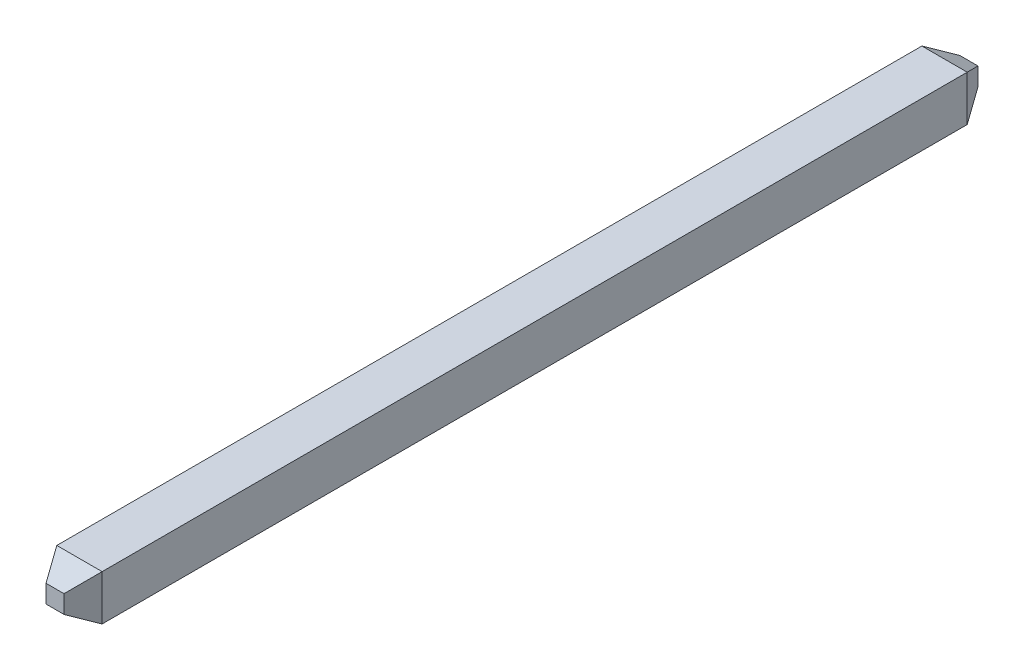
ISO-10303-21;
HEADER;
FILE_DESCRIPTION(('STEP AP214'),'2;1');
FILE_NAME('part.step','',(''),(''),'','','');
FILE_SCHEMA(('AUTOMOTIVE_DESIGN { 1 0 10303 214 1 1 1 1 }'));
ENDSEC;
DATA;
#1=APPLICATION_CONTEXT('core data for automotive mechanical design processes');
#2=APPLICATION_PROTOCOL_DEFINITION('international standard','automotive_design',2000,#1);
#3=PRODUCT_CONTEXT('',#1,'mechanical');
#4=PRODUCT('Part','Part','',(#3));
#5=PRODUCT_RELATED_PRODUCT_CATEGORY('part','',(#4));
#6=PRODUCT_DEFINITION_FORMATION('','',#4);
#7=PRODUCT_DEFINITION_CONTEXT('part definition',#1,'design');
#8=PRODUCT_DEFINITION('design','',#6,#7);
#9=PRODUCT_DEFINITION_SHAPE('','',#8);
#10=(LENGTH_UNIT() NAMED_UNIT(*) SI_UNIT(.MILLI.,.METRE.));
#11=(NAMED_UNIT(*) PLANE_ANGLE_UNIT() SI_UNIT($,.RADIAN.));
#12=(NAMED_UNIT(*) SI_UNIT($,.STERADIAN.) SOLID_ANGLE_UNIT());
#13=UNCERTAINTY_MEASURE_WITH_UNIT(LENGTH_MEASURE(1.E-05),#10,'distance_accuracy_value','');
#14=(GEOMETRIC_REPRESENTATION_CONTEXT(3) GLOBAL_UNCERTAINTY_ASSIGNED_CONTEXT((#13)) GLOBAL_UNIT_ASSIGNED_CONTEXT((#10,
#11,#12)) REPRESENTATION_CONTEXT('',''));
#15=CARTESIAN_POINT('',(0.,0.,0.));
#16=DIRECTION('',(0.,0.,1.));
#17=DIRECTION('',(1.,0.,0.));
#18=AXIS2_PLACEMENT_3D('',#15,#16,#17);
#19=CARTESIAN_POINT('',(7.74011510041924,-1.595,-3.20872569516347));
#20=DIRECTION('',(0.872569516347452,0.,-0.488489958076083));
#21=DIRECTION('',(-0.488489958076083,0.,-0.872569516347452));
#22=AXIS2_PLACEMENT_3D('',#19,#20,#21);
#23=PLANE('',#22);
#24=DIRECTION('',(0.,1.,0.));
#25=VECTOR('',#24,1.);
#26=CARTESIAN_POINT('',(7.93534185664469,-1.595,-2.86000017186176));
#27=LINE('',#26,#25);
#28=CARTESIAN_POINT('',(7.93534185663263,-1.58500002468493,-2.85999984563027));
#29=VERTEX_POINT('',#28);
#30=CARTESIAN_POINT('',(7.93534201729187,-0.954999839641339,-2.8599998849043));
#31=VERTEX_POINT('',#30);
#32=EDGE_CURVE('E145',#29,#31,#27,.T.);
#33=ORIENTED_EDGE('',*,*,#32,.F.);
#34=DIRECTION('',(0.43907261756865,-0.438284036988111,0.784297353956278));
#35=VECTOR('',#34,1.);
#36=CARTESIAN_POINT('',(7.745,-1.395,-3.2));
#37=LINE('',#36,#35);
#38=CARTESIAN_POINT('',(7.745,-1.395,-3.2));
#39=VERTEX_POINT('',#38);
#40=EDGE_CURVE('E142',#39,#29,#37,.T.);
#41=ORIENTED_EDGE('',*,*,#40,.F.);
#42=DIRECTION('',(0.,1.,0.));
#43=VECTOR('',#42,1.);
#44=CARTESIAN_POINT('',(7.745,-1.405,-3.2));
#45=LINE('',#44,#43);
#46=CARTESIAN_POINT('',(7.745,-1.145,-3.2));
#47=VERTEX_POINT('',#46);
#48=EDGE_CURVE('E95',#47,#39,#45,.F.);
#49=ORIENTED_EDGE('',*,*,#48,.F.);
#50=DIRECTION('',(-0.439072617568649,-0.43828403698811,-0.784297353956278));
#51=VECTOR('',#50,1.);
#52=CARTESIAN_POINT('',(7.93534185664468,-0.955000000000001,-2.86000017186176));
#53=LINE('',#52,#51);
#54=EDGE_CURVE('E134',#31,#47,#53,.T.);
#55=ORIENTED_EDGE('',*,*,#54,.F.);
#56=EDGE_LOOP('',(#33,#41,#49,#55));
#57=FACE_BOUND('',#56,.T.);
#58=ADVANCED_FACE('F16',(#57),#23,.T.);
#59=CARTESIAN_POINT('',(7.74036702814295,-1.595,9.50441734607014));
#60=DIRECTION('',(0.873317045523298,0.,0.487152273933376));
#61=DIRECTION('',(0.487152273933376,0.,-0.873317045523298));
#62=AXIS2_PLACEMENT_3D('',#59,#60,#61);
#63=PLANE('',#62);
#64=DIRECTION('',(-0.437799852400914,0.438586917260841,0.784839349959831));
#65=VECTOR('',#64,1.);
#66=CARTESIAN_POINT('',(7.93489789955165,-1.58500031317147,9.15568378706484));
#67=LINE('',#66,#65);
#68=CARTESIAN_POINT('',(7.93489765454993,-1.58500010892315,9.15568368845102));
#69=VERTEX_POINT('',#68);
#70=CARTESIAN_POINT('',(7.74523855088228,-1.395,9.49568417561491));
#71=VERTEX_POINT('',#70);
#72=EDGE_CURVE('E151',#69,#71,#67,.T.);
#73=ORIENTED_EDGE('',*,*,#72,.F.);
#74=DIRECTION('',(0.,1.,0.));
#75=VECTOR('',#74,1.);
#76=CARTESIAN_POINT('',(7.93489853900643,-1.595,9.15568372243698));
#77=LINE('',#76,#75);
#78=CARTESIAN_POINT('',(7.93489765280461,-0.954999822967399,9.15568371270385));
#79=VERTEX_POINT('',#78);
#80=EDGE_CURVE('E106',#79,#69,#77,.F.);
#81=ORIENTED_EDGE('',*,*,#80,.F.);
#82=DIRECTION('',(0.437799852400912,0.438586917260841,-0.784839349959832));
#83=VECTOR('',#82,1.);
#84=CARTESIAN_POINT('',(7.74523855088228,-1.145,9.49568417561491));
#85=LINE('',#84,#83);
#86=CARTESIAN_POINT('',(7.74523855088228,-1.145,9.49568417561491));
#87=VERTEX_POINT('',#86);
#88=EDGE_CURVE('E101',#87,#79,#85,.T.);
#89=ORIENTED_EDGE('',*,*,#88,.F.);
#90=DIRECTION('',(0.,1.,0.));
#91=VECTOR('',#90,1.);
#92=CARTESIAN_POINT('',(7.74523855088228,-1.135,9.49568417561491));
#93=LINE('',#92,#91);
#94=EDGE_CURVE('E19',#71,#87,#93,.T.);
#95=ORIENTED_EDGE('',*,*,#94,.F.);
#96=EDGE_LOOP('',(#73,#81,#89,#95));
#97=FACE_BOUND('',#96,.T.);
#98=ADVANCED_FACE('F103',(#97),#63,.T.);
#99=CARTESIAN_POINT('',(7.48523855088228,-1.135,9.49568417561491));
#100=DIRECTION('',(0.,0.,1.));
#101=DIRECTION('',(1.,0.,0.));
#102=AXIS2_PLACEMENT_3D('',#99,#100,#101);
#103=PLANE('',#102);
#104=DIRECTION('',(1.,0.,0.));
#105=VECTOR('',#104,1.);
#106=CARTESIAN_POINT('',(7.2948966942376,-1.145,9.49568417561491));
#107=LINE('',#106,#105);
#108=CARTESIAN_POINT('',(7.49523855088228,-1.145,9.49568417561491));
#109=VERTEX_POINT('',#108);
#110=EDGE_CURVE('E111',#109,#87,#107,.T.);
#111=ORIENTED_EDGE('',*,*,#110,.F.);
#112=DIRECTION('',(0.,1.,0.));
#113=VECTOR('',#112,1.);
#114=CARTESIAN_POINT('',(7.49523855088228,-1.595,9.49568417561491));
#115=LINE('',#114,#113);
#116=CARTESIAN_POINT('',(7.49523855088228,-1.395,9.49568417561491));
#117=VERTEX_POINT('',#116);
#118=EDGE_CURVE('E162',#117,#109,#115,.T.);
#119=ORIENTED_EDGE('',*,*,#118,.F.);
#120=DIRECTION('',(1.,0.,0.));
#121=VECTOR('',#120,1.);
#122=CARTESIAN_POINT('',(7.2948966942376,-1.395,9.49568417561491));
#123=LINE('',#122,#121);
#124=EDGE_CURVE('E116',#71,#117,#123,.F.);
#125=ORIENTED_EDGE('',*,*,#124,.F.);
#126=ORIENTED_EDGE('',*,*,#94,.T.);
#127=EDGE_LOOP('',(#111,#119,#125,#126));
#128=FACE_BOUND('',#127,.T.);
#129=ADVANCED_FACE('F113',(#128),#103,.T.);
#130=CARTESIAN_POINT('',(7.2948966942376,-1.14987821545568,9.50441360938624));
#131=DIRECTION('',(0.,0.872943377132664,0.487821545567864));
#132=DIRECTION('',(0.,-0.487821545567864,0.872943377132664));
#133=AXIS2_PLACEMENT_3D('',#130,#131,#132);
#134=PLANE('',#133);
#135=DIRECTION('',(-0.439072459537929,0.438284700441656,-0.784297071672515));
#136=VECTOR('',#135,1.);
#137=CARTESIAN_POINT('',(7.49523855088228,-1.145,9.49568417561491));
#138=LINE('',#137,#136);
#139=CARTESIAN_POINT('',(7.3048975037028,-0.954999917527424,9.15568447138296));
#140=VERTEX_POINT('',#139);
#141=EDGE_CURVE('E121',#109,#140,#138,.T.);
#142=ORIENTED_EDGE('',*,*,#141,.F.);
#143=ORIENTED_EDGE('',*,*,#110,.T.);
#144=ORIENTED_EDGE('',*,*,#88,.T.);
#145=DIRECTION('',(1.,0.,0.));
#146=VECTOR('',#145,1.);
#147=CARTESIAN_POINT('',(7.62006658937282,-0.955,9.15568497320463));
#148=LINE('',#147,#146);
#149=EDGE_CURVE('E165',#140,#79,#148,.T.);
#150=ORIENTED_EDGE('',*,*,#149,.F.);
#151=EDGE_LOOP('',(#142,#143,#144,#150));
#152=FACE_BOUND('',#151,.T.);
#153=ADVANCED_FACE('F119',(#152),#134,.T.);
#154=CARTESIAN_POINT('',(7.485,-1.405,-3.2));
#155=DIRECTION('',(0.,0.,-1.));
#156=DIRECTION('',(-1.,0.,0.));
#157=AXIS2_PLACEMENT_3D('',#154,#155,#156);
#158=PLANE('',#157);
#159=ORIENTED_EDGE('',*,*,#48,.T.);
#160=DIRECTION('',(1.,0.,0.));
#161=VECTOR('',#160,1.);
#162=CARTESIAN_POINT('',(7.29534185664468,-1.395,-3.2));
#163=LINE('',#162,#161);
#164=CARTESIAN_POINT('',(7.495,-1.395,-3.2));
#165=VERTEX_POINT('',#164);
#166=EDGE_CURVE('E138',#165,#39,#163,.T.);
#167=ORIENTED_EDGE('',*,*,#166,.F.);
#168=DIRECTION('',(0.,1.,0.));
#169=VECTOR('',#168,1.);
#170=CARTESIAN_POINT('',(7.49500000000001,-1.595,-3.2));
#171=LINE('',#170,#169);
#172=CARTESIAN_POINT('',(7.495,-1.145,-3.2));
#173=VERTEX_POINT('',#172);
#174=EDGE_CURVE('E177',#173,#165,#171,.F.);
#175=ORIENTED_EDGE('',*,*,#174,.F.);
#176=DIRECTION('',(1.,0.,0.));
#177=VECTOR('',#176,1.);
#178=CARTESIAN_POINT('',(7.29534185664468,-1.145,-3.2));
#179=LINE('',#178,#177);
#180=EDGE_CURVE('E128',#47,#173,#179,.F.);
#181=ORIENTED_EDGE('',*,*,#180,.F.);
#182=EDGE_LOOP('',(#159,#167,#175,#181));
#183=FACE_BOUND('',#182,.T.);
#184=ADVANCED_FACE('F229',(#183),#158,.T.);
#185=CARTESIAN_POINT('',(7.29534185664468,-0.950121784544321,-2.85127073809043));
#186=DIRECTION('',(0.,0.872943377132663,-0.487821545567865));
#187=DIRECTION('',(0.,0.487821545567865,0.872943377132663));
#188=AXIS2_PLACEMENT_3D('',#185,#186,#187);
#189=PLANE('',#188);
#190=DIRECTION('',(1.,0.,0.));
#191=VECTOR('',#190,1.);
#192=CARTESIAN_POINT('',(7.62006658937282,-0.955,-2.86000017186176));
#193=LINE('',#192,#191);
#194=CARTESIAN_POINT('',(7.30534144768619,-0.954999293190895,-2.8599984305592));
#195=VERTEX_POINT('',#194);
#196=EDGE_CURVE('E173',#31,#195,#193,.F.);
#197=ORIENTED_EDGE('',*,*,#196,.F.);
#198=ORIENTED_EDGE('',*,*,#54,.T.);
#199=ORIENTED_EDGE('',*,*,#180,.T.);
#200=DIRECTION('',(0.437798396819595,-0.438586429089663,-0.784840434713051));
#201=VECTOR('',#200,1.);
#202=CARTESIAN_POINT('',(7.30534066407532,-0.954999279369218,-2.8599980339447));
#203=LINE('',#202,#201);
#204=EDGE_CURVE('E184',#195,#173,#203,.T.);
#205=ORIENTED_EDGE('',*,*,#204,.F.);
#206=EDGE_LOOP('',(#197,#198,#199,#205));
#207=FACE_BOUND('',#206,.T.);
#208=ADVANCED_FACE('F227',(#207),#189,.T.);
#209=CARTESIAN_POINT('',(7.29534185664468,-1.39012178454432,-3.20872943377133));
#210=DIRECTION('',(0.,-0.872943377132663,-0.487821545567865));
#211=DIRECTION('',(0.,0.487821545567865,-0.872943377132663));
#212=AXIS2_PLACEMENT_3D('',#209,#210,#211);
#213=PLANE('',#212);
#214=ORIENTED_EDGE('',*,*,#166,.T.);
#215=ORIENTED_EDGE('',*,*,#40,.T.);
#216=DIRECTION('',(1.,0.,0.));
#217=VECTOR('',#216,1.);
#218=CARTESIAN_POINT('',(7.29494834685547,-1.585,-2.85999756200982));
#219=LINE('',#218,#217);
#220=CARTESIAN_POINT('',(7.30534198218489,-1.58500027023654,-2.85999898491791));
#221=VERTEX_POINT('',#220);
#222=EDGE_CURVE('E39',#221,#29,#219,.T.);
#223=ORIENTED_EDGE('',*,*,#222,.F.);
#224=DIRECTION('',(-0.437798396819596,-0.43858642908966,0.784840434713052));
#225=VECTOR('',#224,1.);
#226=CARTESIAN_POINT('',(7.49500000000001,-1.395,-3.2));
#227=LINE('',#226,#225);
#228=EDGE_CURVE('E181',#165,#221,#227,.T.);
#229=ORIENTED_EDGE('',*,*,#228,.F.);
#230=EDGE_LOOP('',(#214,#215,#223,#229));
#231=FACE_BOUND('',#230,.T.);
#232=ADVANCED_FACE('F230',(#231),#213,.T.);
#233=CARTESIAN_POINT('',(7.93534630826876,-1.595,-2.98065701705514));
#234=DIRECTION('',(0.999999999319383,0.,3.68949151671205E-05));
#235=DIRECTION('',(3.68949151671205E-05,0.,-0.999999999319383));
#236=AXIS2_PLACEMENT_3D('',#233,#234,#235);
#237=PLANE('',#236);
#238=DIRECTION('',(3.69481335090154E-05,0.,-0.999999999317418));
#239=VECTOR('',#238,1.);
#240=CARTESIAN_POINT('',(7.93489789955165,-0.955,9.15568372241339));
#241=LINE('',#240,#239);
#242=EDGE_CURVE('E169',#79,#31,#241,.T.);
#243=ORIENTED_EDGE('',*,*,#242,.F.);
#244=ORIENTED_EDGE('',*,*,#80,.T.);
#245=DIRECTION('',(-3.69481335090154E-05,0.,0.999999999317418));
#246=VECTOR('',#245,1.);
#247=CARTESIAN_POINT('',(7.93534185664468,-1.585,-2.86000017186176));
#248=LINE('',#247,#246);
#249=EDGE_CURVE('E190',#29,#69,#248,.T.);
#250=ORIENTED_EDGE('',*,*,#249,.F.);
#251=ORIENTED_EDGE('',*,*,#32,.T.);
#252=EDGE_LOOP('',(#243,#244,#250,#251));
#253=FACE_BOUND('',#252,.T.);
#254=ADVANCED_FACE('F232',(#253),#237,.T.);
#255=CARTESIAN_POINT('',(7.2948966942376,-1.58987821545568,9.14695491370534));
#256=DIRECTION('',(0.,-0.872943377132664,0.487821545567864));
#257=DIRECTION('',(0.,-0.487821545567864,-0.872943377132664));
#258=AXIS2_PLACEMENT_3D('',#255,#256,#257);
#259=PLANE('',#258);
#260=ORIENTED_EDGE('',*,*,#124,.T.);
#261=DIRECTION('',(0.439072459537927,0.438284700441663,0.784297071672512));
#262=VECTOR('',#261,1.);
#263=CARTESIAN_POINT('',(7.30489724886555,-1.58499980236491,9.15568533818574));
#264=LINE('',#263,#262);
#265=CARTESIAN_POINT('',(7.30489781760238,-1.5849998839243,9.15568487573227));
#266=VERTEX_POINT('',#265);
#267=EDGE_CURVE('E158',#266,#117,#264,.T.);
#268=ORIENTED_EDGE('',*,*,#267,.F.);
#269=DIRECTION('',(1.,0.,0.));
#270=VECTOR('',#269,1.);
#271=CARTESIAN_POINT('',(7.29494834685547,-1.585,9.15568372241339));
#272=LINE('',#271,#270);
#273=EDGE_CURVE('E194',#69,#266,#272,.F.);
#274=ORIENTED_EDGE('',*,*,#273,.F.);
#275=ORIENTED_EDGE('',*,*,#72,.T.);
#276=EDGE_LOOP('',(#260,#268,#274,#275));
#277=FACE_BOUND('',#276,.T.);
#278=ADVANCED_FACE('F219',(#277),#259,.T.);
#279=CARTESIAN_POINT('',(7.50012345046305,-1.595,9.50440987077839));
#280=DIRECTION('',(-0.872569516347454,0.,0.48848995807608));
#281=DIRECTION('',(0.48848995807608,0.,0.872569516347454));
#282=AXIS2_PLACEMENT_3D('',#279,#280,#281);
#283=PLANE('',#282);
#284=ORIENTED_EDGE('',*,*,#267,.T.);
#285=ORIENTED_EDGE('',*,*,#118,.T.);
#286=ORIENTED_EDGE('',*,*,#141,.T.);
#287=DIRECTION('',(0.,1.,0.));
#288=VECTOR('',#287,1.);
#289=CARTESIAN_POINT('',(7.30489853896028,-1.595,9.15568497322817));
#290=LINE('',#289,#288);
#291=EDGE_CURVE('E197',#266,#140,#290,.T.);
#292=ORIENTED_EDGE('',*,*,#291,.F.);
#293=EDGE_LOOP('',(#284,#285,#286,#292));
#294=FACE_BOUND('',#293,.T.);
#295=ADVANCED_FACE('F222',(#294),#283,.T.);
#296=CARTESIAN_POINT('',(7.62006658937282,-0.955,9.32634470275115));
#297=DIRECTION('',(0.,1.,0.));
#298=DIRECTION('',(0.,0.,1.));
#299=AXIS2_PLACEMENT_3D('',#296,#297,#298);
#300=PLANE('',#299);
#301=ORIENTED_EDGE('',*,*,#196,.T.);
#302=DIRECTION('',(-3.68949151674615E-05,0.,0.999999999319383));
#303=VECTOR('',#302,1.);
#304=CARTESIAN_POINT('',(7.30489224235438,-0.955000197635094,9.32634821671993));
#305=LINE('',#304,#303);
#306=EDGE_CURVE('E201',#140,#195,#305,.F.);
#307=ORIENTED_EDGE('',*,*,#306,.F.);
#308=ORIENTED_EDGE('',*,*,#149,.T.);
#309=ORIENTED_EDGE('',*,*,#242,.T.);
#310=EDGE_LOOP('',(#301,#307,#308,#309));
#311=FACE_BOUND('',#310,.T.);
#312=ADVANCED_FACE('F224',(#311),#300,.T.);
#313=CARTESIAN_POINT('',(7.49987152273934,-1.595,-3.20873317045523));
#314=DIRECTION('',(-0.873317045523296,0.,-0.487152273933378));
#315=DIRECTION('',(-0.487152273933378,0.,0.873317045523296));
#316=AXIS2_PLACEMENT_3D('',#313,#314,#315);
#317=PLANE('',#316);
#318=DIRECTION('',(0.,1.,0.));
#319=VECTOR('',#318,1.);
#320=CARTESIAN_POINT('',(7.30534185654839,-1.595,-2.85999756199704));
#321=LINE('',#320,#319);
#322=EDGE_CURVE('E26',#195,#221,#321,.F.);
#323=ORIENTED_EDGE('',*,*,#322,.F.);
#324=ORIENTED_EDGE('',*,*,#204,.T.);
#325=ORIENTED_EDGE('',*,*,#174,.T.);
#326=ORIENTED_EDGE('',*,*,#228,.T.);
#327=EDGE_LOOP('',(#323,#324,#325,#326));
#328=FACE_BOUND('',#327,.T.);
#329=ADVANCED_FACE('F213',(#328),#317,.T.);
#330=CARTESIAN_POINT('',(7.29494834685547,-1.585,3.17284922525592));
#331=DIRECTION('',(0.,-1.,0.));
#332=DIRECTION('',(0.,0.,-1.));
#333=AXIS2_PLACEMENT_3D('',#330,#331,#332);
#334=PLANE('',#333);
#335=ORIENTED_EDGE('',*,*,#249,.T.);
#336=ORIENTED_EDGE('',*,*,#273,.T.);
#337=DIRECTION('',(-3.68949151674615E-05,0.,0.999999999319383));
#338=VECTOR('',#337,1.);
#339=CARTESIAN_POINT('',(7.30489224235438,-1.58500072063078,9.32634821671993));
#340=LINE('',#339,#338);
#341=EDGE_CURVE('E11',#221,#266,#340,.T.);
#342=ORIENTED_EDGE('',*,*,#341,.F.);
#343=ORIENTED_EDGE('',*,*,#222,.T.);
#344=EDGE_LOOP('',(#335,#336,#342,#343));
#345=FACE_BOUND('',#344,.T.);
#346=ADVANCED_FACE('F215',(#345),#334,.T.);
#347=CARTESIAN_POINT('',(7.30489224235438,-1.595,9.32634821671993));
#348=DIRECTION('',(-0.999999999319383,0.,-3.68949151674615E-05));
#349=DIRECTION('',(-3.68949151674615E-05,0.,0.999999999319383));
#350=AXIS2_PLACEMENT_3D('',#347,#348,#349);
#351=PLANE('',#350);
#352=ORIENTED_EDGE('',*,*,#322,.T.);
#353=ORIENTED_EDGE('',*,*,#341,.T.);
#354=ORIENTED_EDGE('',*,*,#291,.T.);
#355=ORIENTED_EDGE('',*,*,#306,.T.);
#356=EDGE_LOOP('',(#352,#353,#354,#355));
#357=FACE_BOUND('',#356,.T.);
#358=ADVANCED_FACE('F209',(#357),#351,.T.);
#359=CLOSED_SHELL('',(#58,#98,#129,#153,#184,#208,#232,#254,#278,#295,#312,#329,#346,#358));
#360=MANIFOLD_SOLID_BREP('B1',#359);
#361=ADVANCED_BREP_SHAPE_REPRESENTATION('',(#18,#360),#14);
#362=SHAPE_DEFINITION_REPRESENTATION(#9,#361);
ENDSEC;
END-ISO-10303-21;
